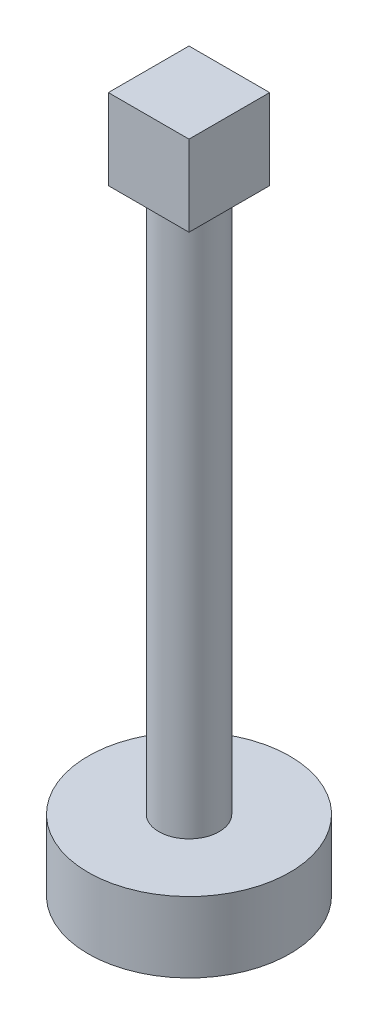
ISO-10303-21;
HEADER;
FILE_DESCRIPTION(('STEP AP214'),'2;1');
FILE_NAME('part.step','',(''),(''),'','','');
FILE_SCHEMA(('AUTOMOTIVE_DESIGN { 1 0 10303 214 1 1 1 1 }'));
ENDSEC;
DATA;
#1=APPLICATION_CONTEXT('core data for automotive mechanical design processes');
#2=APPLICATION_PROTOCOL_DEFINITION('international standard','automotive_design',2000,#1);
#3=PRODUCT_CONTEXT('',#1,'mechanical');
#4=PRODUCT('Part','Part','',(#3));
#5=PRODUCT_RELATED_PRODUCT_CATEGORY('part','',(#4));
#6=PRODUCT_DEFINITION_FORMATION('','',#4);
#7=PRODUCT_DEFINITION_CONTEXT('part definition',#1,'design');
#8=PRODUCT_DEFINITION('design','',#6,#7);
#9=PRODUCT_DEFINITION_SHAPE('','',#8);
#10=(LENGTH_UNIT() NAMED_UNIT(*) SI_UNIT(.MILLI.,.METRE.));
#11=(NAMED_UNIT(*) PLANE_ANGLE_UNIT() SI_UNIT($,.RADIAN.));
#12=(NAMED_UNIT(*) SI_UNIT($,.STERADIAN.) SOLID_ANGLE_UNIT());
#13=UNCERTAINTY_MEASURE_WITH_UNIT(LENGTH_MEASURE(1.E-05),#10,'distance_accuracy_value','');
#14=(GEOMETRIC_REPRESENTATION_CONTEXT(3) GLOBAL_UNCERTAINTY_ASSIGNED_CONTEXT((#13)) GLOBAL_UNIT_ASSIGNED_CONTEXT((#10,
#11,#12)) REPRESENTATION_CONTEXT('',''));
#15=CARTESIAN_POINT('',(0.,0.,0.));
#16=DIRECTION('',(0.,0.,1.));
#17=DIRECTION('',(1.,0.,0.));
#18=AXIS2_PLACEMENT_3D('',#15,#16,#17);
#19=CARTESIAN_POINT('',(0.,35.,0.));
#20=DIRECTION('',(0.,1.,0.));
#21=DIRECTION('',(0.,0.,1.));
#22=AXIS2_PLACEMENT_3D('',#19,#20,#21);
#23=PLANE('',#22);
#24=CARTESIAN_POINT('',(0.,35.,0.));
#25=DIRECTION('',(0.,1.,0.));
#26=DIRECTION('',(0.,0.,1.));
#27=AXIS2_PLACEMENT_3D('',#24,#25,#26);
#28=CIRCLE('',#27,50.);
#29=CARTESIAN_POINT('',(0.,35.,50.));
#30=VERTEX_POINT('',#29);
#31=EDGE_CURVE('E11',#30,#30,#28,.T.);
#32=ORIENTED_EDGE('',*,*,#31,.T.);
#33=EDGE_LOOP('',(#32));
#34=FACE_BOUND('',#33,.T.);
#35=CARTESIAN_POINT('',(0.,35.,0.));
#36=DIRECTION('',(0.,1.,0.));
#37=DIRECTION('',(0.,0.,1.));
#38=AXIS2_PLACEMENT_3D('',#35,#36,#37);
#39=CIRCLE('',#38,15.);
#40=CARTESIAN_POINT('',(0.,35.,15.));
#41=VERTEX_POINT('',#40);
#42=EDGE_CURVE('E109',#41,#41,#39,.T.);
#43=ORIENTED_EDGE('',*,*,#42,.F.);
#44=EDGE_LOOP('',(#43));
#45=FACE_BOUND('',#44,.T.);
#46=ADVANCED_FACE('F32',(#34,#45),#23,.T.);
#47=CARTESIAN_POINT('',(0.,35.,0.));
#48=DIRECTION('',(0.,-1.,0.));
#49=DIRECTION('',(0.,0.,-1.));
#50=AXIS2_PLACEMENT_3D('',#47,#48,#49);
#51=CYLINDRICAL_SURFACE('',#50,50.);
#52=ORIENTED_EDGE('',*,*,#31,.F.);
#53=EDGE_LOOP('',(#52));
#54=FACE_BOUND('',#53,.T.);
#55=CARTESIAN_POINT('',(0.,0.,0.));
#56=DIRECTION('',(0.,1.,0.));
#57=DIRECTION('',(0.,0.,1.));
#58=AXIS2_PLACEMENT_3D('',#55,#56,#57);
#59=CIRCLE('',#58,50.);
#60=CARTESIAN_POINT('',(0.,0.,50.));
#61=VERTEX_POINT('',#60);
#62=EDGE_CURVE('E36',#61,#61,#59,.T.);
#63=ORIENTED_EDGE('',*,*,#62,.T.);
#64=EDGE_LOOP('',(#63));
#65=FACE_BOUND('',#64,.T.);
#66=ADVANCED_FACE('F34',(#54,#65),#51,.T.);
#67=CARTESIAN_POINT('',(0.,0.,0.));
#68=DIRECTION('',(0.,1.,0.));
#69=DIRECTION('',(0.,0.,1.));
#70=AXIS2_PLACEMENT_3D('',#67,#68,#69);
#71=PLANE('',#70);
#72=ORIENTED_EDGE('',*,*,#62,.F.);
#73=EDGE_LOOP('',(#72));
#74=FACE_BOUND('',#73,.T.);
#75=ADVANCED_FACE('F124',(#74),#71,.F.);
#76=CARTESIAN_POINT('',(0.,305.,0.));
#77=DIRECTION('',(0.,-1.,0.));
#78=DIRECTION('',(0.,0.,-1.));
#79=AXIS2_PLACEMENT_3D('',#76,#77,#78);
#80=CYLINDRICAL_SURFACE('',#79,15.);
#81=CARTESIAN_POINT('',(0.,305.,0.));
#82=DIRECTION('',(0.,1.,0.));
#83=DIRECTION('',(0.,0.,1.));
#84=AXIS2_PLACEMENT_3D('',#81,#82,#83);
#85=CIRCLE('',#84,15.);
#86=CARTESIAN_POINT('',(0.,305.,15.));
#87=VERTEX_POINT('',#86);
#88=EDGE_CURVE('E110',#87,#87,#85,.T.);
#89=ORIENTED_EDGE('',*,*,#88,.F.);
#90=EDGE_LOOP('',(#89));
#91=FACE_BOUND('',#90,.T.);
#92=ORIENTED_EDGE('',*,*,#42,.T.);
#93=EDGE_LOOP('',(#92));
#94=FACE_BOUND('',#93,.T.);
#95=ADVANCED_FACE('F116',(#91,#94),#80,.T.);
#96=CARTESIAN_POINT('',(0.,305.,0.));
#97=DIRECTION('',(0.,-1.,0.));
#98=DIRECTION('',(0.,0.,-1.));
#99=AXIS2_PLACEMENT_3D('',#96,#97,#98);
#100=PLANE('',#99);
#101=DIRECTION('',(0.,0.,-1.));
#102=VECTOR('',#101,1.);
#103=CARTESIAN_POINT('',(20.,305.,20.));
#104=LINE('',#103,#102);
#105=CARTESIAN_POINT('',(20.,305.,20.));
#106=VERTEX_POINT('',#105);
#107=CARTESIAN_POINT('',(20.,305.,-20.));
#108=VERTEX_POINT('',#107);
#109=EDGE_CURVE('E100',#106,#108,#104,.T.);
#110=ORIENTED_EDGE('',*,*,#109,.F.);
#111=DIRECTION('',(1.,0.,0.));
#112=VECTOR('',#111,1.);
#113=CARTESIAN_POINT('',(-20.,305.,20.));
#114=LINE('',#113,#112);
#115=CARTESIAN_POINT('',(-20.,305.,20.));
#116=VERTEX_POINT('',#115);
#117=EDGE_CURVE('E72',#116,#106,#114,.T.);
#118=ORIENTED_EDGE('',*,*,#117,.F.);
#119=DIRECTION('',(0.,0.,1.));
#120=VECTOR('',#119,1.);
#121=CARTESIAN_POINT('',(-20.,305.,20.));
#122=LINE('',#121,#120);
#123=CARTESIAN_POINT('',(-20.,305.,-20.));
#124=VERTEX_POINT('',#123);
#125=EDGE_CURVE('E66',#124,#116,#122,.T.);
#126=ORIENTED_EDGE('',*,*,#125,.F.);
#127=DIRECTION('',(-1.,0.,0.));
#128=VECTOR('',#127,1.);
#129=CARTESIAN_POINT('',(-20.,305.,-20.));
#130=LINE('',#129,#128);
#131=EDGE_CURVE('E90',#108,#124,#130,.T.);
#132=ORIENTED_EDGE('',*,*,#131,.F.);
#133=EDGE_LOOP('',(#110,#118,#126,#132));
#134=FACE_BOUND('',#133,.T.);
#135=ORIENTED_EDGE('',*,*,#88,.T.);
#136=EDGE_LOOP('',(#135));
#137=FACE_BOUND('',#136,.T.);
#138=ADVANCED_FACE('F133',(#134,#137),#100,.T.);
#139=CARTESIAN_POINT('',(20.,345.,20.));
#140=DIRECTION('',(-1.,0.,0.));
#141=DIRECTION('',(0.,0.,1.));
#142=AXIS2_PLACEMENT_3D('',#139,#140,#141);
#143=PLANE('',#142);
#144=ORIENTED_EDGE('',*,*,#109,.T.);
#145=DIRECTION('',(0.,-1.,0.));
#146=VECTOR('',#145,1.);
#147=CARTESIAN_POINT('',(20.,345.,-20.));
#148=LINE('',#147,#146);
#149=CARTESIAN_POINT('',(20.,345.,-20.));
#150=VERTEX_POINT('',#149);
#151=EDGE_CURVE('E91',#150,#108,#148,.T.);
#152=ORIENTED_EDGE('',*,*,#151,.F.);
#153=DIRECTION('',(0.,0.,-1.));
#154=VECTOR('',#153,1.);
#155=CARTESIAN_POINT('',(20.,345.,20.));
#156=LINE('',#155,#154);
#157=CARTESIAN_POINT('',(20.,345.,20.));
#158=VERTEX_POINT('',#157);
#159=EDGE_CURVE('E85',#158,#150,#156,.T.);
#160=ORIENTED_EDGE('',*,*,#159,.F.);
#161=DIRECTION('',(0.,-1.,0.));
#162=VECTOR('',#161,1.);
#163=CARTESIAN_POINT('',(20.,345.,20.));
#164=LINE('',#163,#162);
#165=EDGE_CURVE('E96',#158,#106,#164,.T.);
#166=ORIENTED_EDGE('',*,*,#165,.T.);
#167=EDGE_LOOP('',(#144,#152,#160,#166));
#168=FACE_BOUND('',#167,.T.);
#169=ADVANCED_FACE('F141',(#168),#143,.F.);
#170=CARTESIAN_POINT('',(-20.,345.,-20.));
#171=DIRECTION('',(0.,0.,1.));
#172=DIRECTION('',(1.,0.,0.));
#173=AXIS2_PLACEMENT_3D('',#170,#171,#172);
#174=PLANE('',#173);
#175=ORIENTED_EDGE('',*,*,#131,.T.);
#176=DIRECTION('',(0.,-1.,0.));
#177=VECTOR('',#176,1.);
#178=CARTESIAN_POINT('',(-20.,345.,-20.));
#179=LINE('',#178,#177);
#180=CARTESIAN_POINT('',(-20.,345.,-20.));
#181=VERTEX_POINT('',#180);
#182=EDGE_CURVE('E88',#181,#124,#179,.T.);
#183=ORIENTED_EDGE('',*,*,#182,.F.);
#184=DIRECTION('',(-1.,0.,0.));
#185=VECTOR('',#184,1.);
#186=CARTESIAN_POINT('',(-20.,345.,-20.));
#187=LINE('',#186,#185);
#188=EDGE_CURVE('E80',#150,#181,#187,.T.);
#189=ORIENTED_EDGE('',*,*,#188,.F.);
#190=ORIENTED_EDGE('',*,*,#151,.T.);
#191=EDGE_LOOP('',(#175,#183,#189,#190));
#192=FACE_BOUND('',#191,.T.);
#193=ADVANCED_FACE('F89',(#192),#174,.F.);
#194=CARTESIAN_POINT('',(-20.,345.,20.));
#195=DIRECTION('',(1.,0.,0.));
#196=DIRECTION('',(0.,0.,-1.));
#197=AXIS2_PLACEMENT_3D('',#194,#195,#196);
#198=PLANE('',#197);
#199=ORIENTED_EDGE('',*,*,#125,.T.);
#200=DIRECTION('',(0.,-1.,0.));
#201=VECTOR('',#200,1.);
#202=CARTESIAN_POINT('',(-20.,345.,20.));
#203=LINE('',#202,#201);
#204=CARTESIAN_POINT('',(-20.,345.,20.));
#205=VERTEX_POINT('',#204);
#206=EDGE_CURVE('E92',#205,#116,#203,.T.);
#207=ORIENTED_EDGE('',*,*,#206,.F.);
#208=DIRECTION('',(0.,0.,1.));
#209=VECTOR('',#208,1.);
#210=CARTESIAN_POINT('',(-20.,345.,20.));
#211=LINE('',#210,#209);
#212=EDGE_CURVE('E83',#181,#205,#211,.T.);
#213=ORIENTED_EDGE('',*,*,#212,.F.);
#214=ORIENTED_EDGE('',*,*,#182,.T.);
#215=EDGE_LOOP('',(#199,#207,#213,#214));
#216=FACE_BOUND('',#215,.T.);
#217=ADVANCED_FACE('F94',(#216),#198,.F.);
#218=CARTESIAN_POINT('',(-20.,345.,20.));
#219=DIRECTION('',(0.,0.,-1.));
#220=DIRECTION('',(-1.,0.,0.));
#221=AXIS2_PLACEMENT_3D('',#218,#219,#220);
#222=PLANE('',#221);
#223=ORIENTED_EDGE('',*,*,#117,.T.);
#224=ORIENTED_EDGE('',*,*,#165,.F.);
#225=DIRECTION('',(1.,0.,0.));
#226=VECTOR('',#225,1.);
#227=CARTESIAN_POINT('',(-20.,345.,20.));
#228=LINE('',#227,#226);
#229=EDGE_CURVE('E49',#205,#158,#228,.T.);
#230=ORIENTED_EDGE('',*,*,#229,.F.);
#231=ORIENTED_EDGE('',*,*,#206,.T.);
#232=EDGE_LOOP('',(#223,#224,#230,#231));
#233=FACE_BOUND('',#232,.T.);
#234=ADVANCED_FACE('F153',(#233),#222,.F.);
#235=CARTESIAN_POINT('',(0.,345.,0.));
#236=DIRECTION('',(0.,-1.,0.));
#237=DIRECTION('',(0.,0.,-1.));
#238=AXIS2_PLACEMENT_3D('',#235,#236,#237);
#239=PLANE('',#238);
#240=ORIENTED_EDGE('',*,*,#159,.T.);
#241=ORIENTED_EDGE('',*,*,#188,.T.);
#242=ORIENTED_EDGE('',*,*,#212,.T.);
#243=ORIENTED_EDGE('',*,*,#229,.T.);
#244=EDGE_LOOP('',(#240,#241,#242,#243));
#245=FACE_BOUND('',#244,.T.);
#246=ADVANCED_FACE('F81',(#245),#239,.F.);
#247=CLOSED_SHELL('',(#46,#66,#75,#95,#138,#169,#193,#217,#234,#246));
#248=MANIFOLD_SOLID_BREP('B2',#247);
#249=ADVANCED_BREP_SHAPE_REPRESENTATION('',(#18,#248),#14);
#250=SHAPE_DEFINITION_REPRESENTATION(#9,#249);
ENDSEC;
END-ISO-10303-21;
